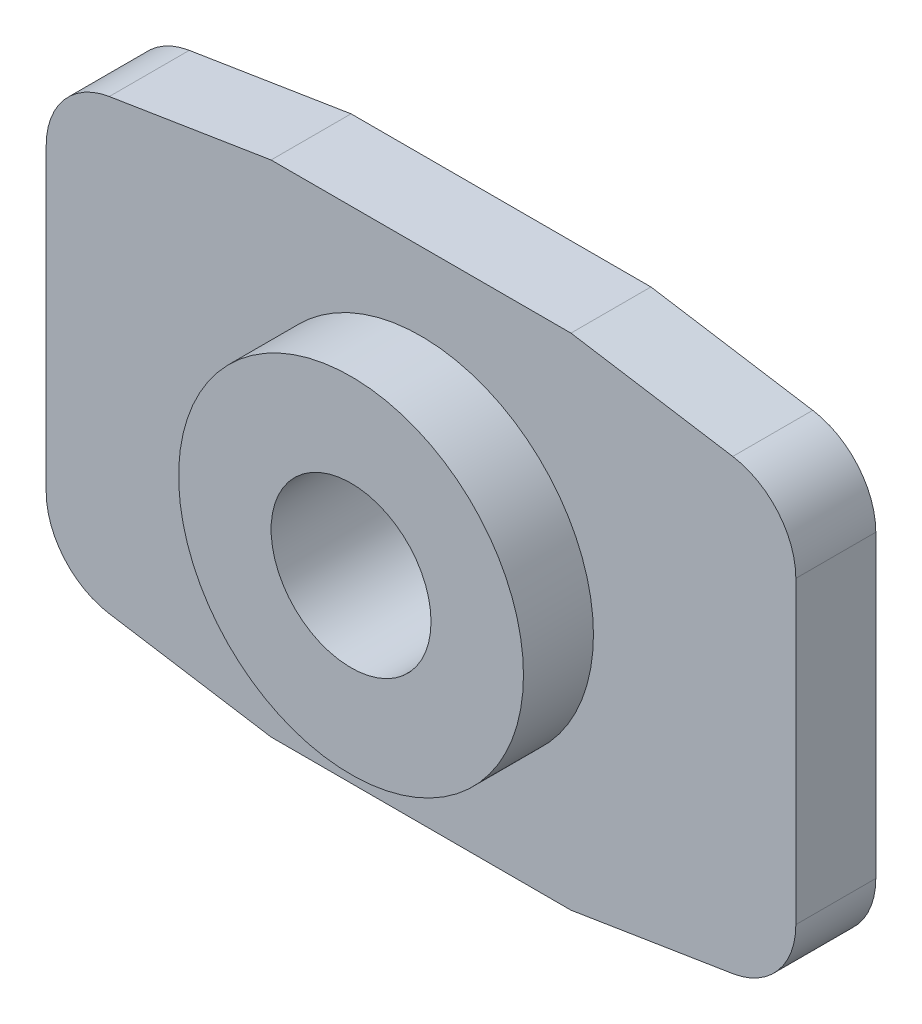
ISO-10303-21;
HEADER;
FILE_DESCRIPTION(('STEP AP214'),'2;1');
FILE_NAME('part.step','',(''),(''),'','','');
FILE_SCHEMA(('AUTOMOTIVE_DESIGN { 1 0 10303 214 1 1 1 1 }'));
ENDSEC;
DATA;
#1=APPLICATION_CONTEXT('core data for automotive mechanical design processes');
#2=APPLICATION_PROTOCOL_DEFINITION('international standard','automotive_design',2000,#1);
#3=PRODUCT_CONTEXT('',#1,'mechanical');
#4=PRODUCT('Part','Part','',(#3));
#5=PRODUCT_RELATED_PRODUCT_CATEGORY('part','',(#4));
#6=PRODUCT_DEFINITION_FORMATION('','',#4);
#7=PRODUCT_DEFINITION_CONTEXT('part definition',#1,'design');
#8=PRODUCT_DEFINITION('design','',#6,#7);
#9=PRODUCT_DEFINITION_SHAPE('','',#8);
#10=(LENGTH_UNIT() NAMED_UNIT(*) SI_UNIT(.MILLI.,.METRE.));
#11=(NAMED_UNIT(*) PLANE_ANGLE_UNIT() SI_UNIT($,.RADIAN.));
#12=(NAMED_UNIT(*) SI_UNIT($,.STERADIAN.) SOLID_ANGLE_UNIT());
#13=UNCERTAINTY_MEASURE_WITH_UNIT(LENGTH_MEASURE(1.E-05),#10,'distance_accuracy_value','');
#14=(GEOMETRIC_REPRESENTATION_CONTEXT(3) GLOBAL_UNCERTAINTY_ASSIGNED_CONTEXT((#13)) GLOBAL_UNIT_ASSIGNED_CONTEXT((#10,
#11,#12)) REPRESENTATION_CONTEXT('',''));
#15=CARTESIAN_POINT('',(0.,0.,0.));
#16=DIRECTION('',(0.,0.,1.));
#17=DIRECTION('',(1.,0.,0.));
#18=AXIS2_PLACEMENT_3D('',#15,#16,#17);
#19=CARTESIAN_POINT('',(6.,3.,1.6));
#20=DIRECTION('',(0.,0.,1.));
#21=DIRECTION('',(1.,0.,0.));
#22=AXIS2_PLACEMENT_3D('',#19,#20,#21);
#23=PLANE('',#22);
#24=CARTESIAN_POINT('',(6.,3.,1.6));
#25=DIRECTION('',(0.,0.,1.));
#26=DIRECTION('',(1.,0.,0.));
#27=AXIS2_PLACEMENT_3D('',#24,#25,#26);
#28=CIRCLE('',#27,1.5);
#29=CARTESIAN_POINT('',(7.5,3.,1.6));
#30=VERTEX_POINT('',#29);
#31=CARTESIAN_POINT('',(6.23739675280407,4.48109512920611,1.6));
#32=VERTEX_POINT('',#31);
#33=EDGE_CURVE('E198',#30,#32,#28,.T.);
#34=ORIENTED_EDGE('',*,*,#33,.T.);
#35=DIRECTION('',(-0.987396752804077,0.158264501869385,0.));
#36=VECTOR('',#35,1.);
#37=CARTESIAN_POINT('',(6.23739675280407,4.48109512920611,1.6));
#38=LINE('',#37,#36);
#39=CARTESIAN_POINT('',(3.,5.,1.6));
#40=VERTEX_POINT('',#39);
#41=EDGE_CURVE('E107',#32,#40,#38,.T.);
#42=ORIENTED_EDGE('',*,*,#41,.T.);
#43=DIRECTION('',(-1.,0.,0.));
#44=VECTOR('',#43,1.);
#45=CARTESIAN_POINT('',(-3.,5.,1.6));
#46=LINE('',#45,#44);
#47=CARTESIAN_POINT('',(-3.,5.,1.6));
#48=VERTEX_POINT('',#47);
#49=EDGE_CURVE('E237',#40,#48,#46,.T.);
#50=ORIENTED_EDGE('',*,*,#49,.T.);
#51=DIRECTION('',(-0.987396752804077,-0.158264501869386,0.));
#52=VECTOR('',#51,1.);
#53=CARTESIAN_POINT('',(-6.23739675280407,4.48109512920611,1.6));
#54=LINE('',#53,#52);
#55=CARTESIAN_POINT('',(-6.23739675280407,4.48109512920611,1.6));
#56=VERTEX_POINT('',#55);
#57=EDGE_CURVE('E256',#48,#56,#54,.T.);
#58=ORIENTED_EDGE('',*,*,#57,.T.);
#59=CARTESIAN_POINT('',(-6.,3.,1.6));
#60=DIRECTION('',(0.,0.,1.));
#61=DIRECTION('',(-1.,0.,0.));
#62=AXIS2_PLACEMENT_3D('',#59,#60,#61);
#63=CIRCLE('',#62,1.5);
#64=CARTESIAN_POINT('',(-7.5,3.,1.6));
#65=VERTEX_POINT('',#64);
#66=EDGE_CURVE('E252',#56,#65,#63,.T.);
#67=ORIENTED_EDGE('',*,*,#66,.T.);
#68=DIRECTION('',(0.,-1.,0.));
#69=VECTOR('',#68,1.);
#70=CARTESIAN_POINT('',(-7.5,-3.,1.6));
#71=LINE('',#70,#69);
#72=CARTESIAN_POINT('',(-7.5,-3.,1.6));
#73=VERTEX_POINT('',#72);
#74=EDGE_CURVE('E255',#65,#73,#71,.T.);
#75=ORIENTED_EDGE('',*,*,#74,.T.);
#76=CARTESIAN_POINT('',(-6.,-3.,1.6));
#77=DIRECTION('',(0.,0.,1.));
#78=DIRECTION('',(1.,0.,0.));
#79=AXIS2_PLACEMENT_3D('',#76,#77,#78);
#80=CIRCLE('',#79,1.5);
#81=CARTESIAN_POINT('',(-6.23739675280407,-4.48109512920612,1.6));
#82=VERTEX_POINT('',#81);
#83=EDGE_CURVE('E261',#73,#82,#80,.T.);
#84=ORIENTED_EDGE('',*,*,#83,.T.);
#85=DIRECTION('',(0.987396752804077,-0.158264501869385,0.));
#86=VECTOR('',#85,1.);
#87=CARTESIAN_POINT('',(-6.23739675280407,-4.48109512920612,1.6));
#88=LINE('',#87,#86);
#89=CARTESIAN_POINT('',(-3.,-5.,1.6));
#90=VERTEX_POINT('',#89);
#91=EDGE_CURVE('E269',#82,#90,#88,.T.);
#92=ORIENTED_EDGE('',*,*,#91,.T.);
#93=DIRECTION('',(1.,0.,0.));
#94=VECTOR('',#93,1.);
#95=CARTESIAN_POINT('',(-3.,-5.,1.6));
#96=LINE('',#95,#94);
#97=CARTESIAN_POINT('',(3.,-5.,1.6));
#98=VERTEX_POINT('',#97);
#99=EDGE_CURVE('E138',#90,#98,#96,.T.);
#100=ORIENTED_EDGE('',*,*,#99,.T.);
#101=DIRECTION('',(0.987396752804077,0.158264501869385,0.));
#102=VECTOR('',#101,1.);
#103=CARTESIAN_POINT('',(6.23739675280407,-4.48109512920611,1.6));
#104=LINE('',#103,#102);
#105=CARTESIAN_POINT('',(6.23739675280407,-4.48109512920612,1.6));
#106=VERTEX_POINT('',#105);
#107=EDGE_CURVE('E132',#98,#106,#104,.T.);
#108=ORIENTED_EDGE('',*,*,#107,.T.);
#109=CARTESIAN_POINT('',(6.,-3.,1.6));
#110=DIRECTION('',(0.,0.,1.));
#111=DIRECTION('',(-1.,0.,0.));
#112=AXIS2_PLACEMENT_3D('',#109,#110,#111);
#113=CIRCLE('',#112,1.5);
#114=CARTESIAN_POINT('',(7.5,-3.,1.6));
#115=VERTEX_POINT('',#114);
#116=EDGE_CURVE('E136',#106,#115,#113,.T.);
#117=ORIENTED_EDGE('',*,*,#116,.T.);
#118=DIRECTION('',(0.,1.,0.));
#119=VECTOR('',#118,1.);
#120=CARTESIAN_POINT('',(7.5,-3.,1.6));
#121=LINE('',#120,#119);
#122=EDGE_CURVE('E52',#115,#30,#121,.T.);
#123=ORIENTED_EDGE('',*,*,#122,.T.);
#124=EDGE_LOOP('',(#34,#42,#50,#58,#67,#75,#84,#92,#100,#108,#117,#123));
#125=FACE_BOUND('',#124,.T.);
#126=CARTESIAN_POINT('',(0.,0.,1.6));
#127=DIRECTION('',(0.,0.,1.));
#128=DIRECTION('',(1.,0.,0.));
#129=AXIS2_PLACEMENT_3D('',#126,#127,#128);
#130=CIRCLE('',#129,3.45);
#131=CARTESIAN_POINT('',(3.45,0.,1.6));
#132=VERTEX_POINT('',#131);
#133=EDGE_CURVE('E336',#132,#132,#130,.T.);
#134=ORIENTED_EDGE('',*,*,#133,.F.);
#135=EDGE_LOOP('',(#134));
#136=FACE_BOUND('',#135,.T.);
#137=ADVANCED_FACE('F34',(#125,#136),#23,.T.);
#138=CARTESIAN_POINT('',(6.,3.,1.6));
#139=DIRECTION('',(0.,0.,-1.));
#140=DIRECTION('',(-1.,0.,0.));
#141=AXIS2_PLACEMENT_3D('',#138,#139,#140);
#142=CYLINDRICAL_SURFACE('',#141,1.5);
#143=CARTESIAN_POINT('',(6.,3.,0.));
#144=DIRECTION('',(0.,0.,1.));
#145=DIRECTION('',(1.,0.,0.));
#146=AXIS2_PLACEMENT_3D('',#143,#144,#145);
#147=CIRCLE('',#146,1.5);
#148=CARTESIAN_POINT('',(7.5,3.,0.));
#149=VERTEX_POINT('',#148);
#150=CARTESIAN_POINT('',(6.23739675280407,4.48109512920611,0.));
#151=VERTEX_POINT('',#150);
#152=EDGE_CURVE('E163',#149,#151,#147,.T.);
#153=ORIENTED_EDGE('',*,*,#152,.T.);
#154=DIRECTION('',(0.,0.,-1.));
#155=VECTOR('',#154,1.);
#156=CARTESIAN_POINT('',(6.23739675280407,4.48109512920611,1.6));
#157=LINE('',#156,#155);
#158=EDGE_CURVE('E11',#32,#151,#157,.T.);
#159=ORIENTED_EDGE('',*,*,#158,.F.);
#160=ORIENTED_EDGE('',*,*,#33,.F.);
#161=DIRECTION('',(0.,0.,-1.));
#162=VECTOR('',#161,1.);
#163=CARTESIAN_POINT('',(7.5,3.,1.6));
#164=LINE('',#163,#162);
#165=EDGE_CURVE('E159',#30,#149,#164,.T.);
#166=ORIENTED_EDGE('',*,*,#165,.T.);
#167=EDGE_LOOP('',(#153,#159,#160,#166));
#168=FACE_BOUND('',#167,.T.);
#169=ADVANCED_FACE('F36',(#168),#142,.T.);
#170=CARTESIAN_POINT('',(6.23739675280407,4.48109512920611,1.6));
#171=DIRECTION('',(-0.158264501869385,-0.987396752804077,0.));
#172=DIRECTION('',(0.987396752804077,-0.158264501869385,0.));
#173=AXIS2_PLACEMENT_3D('',#170,#171,#172);
#174=PLANE('',#173);
#175=DIRECTION('',(-0.987396752804077,0.158264501869385,0.));
#176=VECTOR('',#175,1.);
#177=CARTESIAN_POINT('',(6.23739675280407,4.48109512920611,0.));
#178=LINE('',#177,#176);
#179=CARTESIAN_POINT('',(3.,5.,0.));
#180=VERTEX_POINT('',#179);
#181=EDGE_CURVE('E167',#151,#180,#178,.T.);
#182=ORIENTED_EDGE('',*,*,#181,.T.);
#183=DIRECTION('',(0.,0.,-1.));
#184=VECTOR('',#183,1.);
#185=CARTESIAN_POINT('',(3.,5.,1.6));
#186=LINE('',#185,#184);
#187=EDGE_CURVE('E44',#40,#180,#186,.T.);
#188=ORIENTED_EDGE('',*,*,#187,.F.);
#189=ORIENTED_EDGE('',*,*,#41,.F.);
#190=ORIENTED_EDGE('',*,*,#158,.T.);
#191=EDGE_LOOP('',(#182,#188,#189,#190));
#192=FACE_BOUND('',#191,.T.);
#193=ADVANCED_FACE('F324',(#192),#174,.F.);
#194=CARTESIAN_POINT('',(-3.,5.,1.6));
#195=DIRECTION('',(0.,-1.,0.));
#196=DIRECTION('',(0.,0.,-1.));
#197=AXIS2_PLACEMENT_3D('',#194,#195,#196);
#198=PLANE('',#197);
#199=DIRECTION('',(-1.,0.,0.));
#200=VECTOR('',#199,1.);
#201=CARTESIAN_POINT('',(-3.,5.,0.));
#202=LINE('',#201,#200);
#203=CARTESIAN_POINT('',(-3.,5.,0.));
#204=VERTEX_POINT('',#203);
#205=EDGE_CURVE('E171',#180,#204,#202,.T.);
#206=ORIENTED_EDGE('',*,*,#205,.T.);
#207=DIRECTION('',(0.,0.,-1.));
#208=VECTOR('',#207,1.);
#209=CARTESIAN_POINT('',(-3.,5.,1.6));
#210=LINE('',#209,#208);
#211=EDGE_CURVE('E224',#48,#204,#210,.T.);
#212=ORIENTED_EDGE('',*,*,#211,.F.);
#213=ORIENTED_EDGE('',*,*,#49,.F.);
#214=ORIENTED_EDGE('',*,*,#187,.T.);
#215=EDGE_LOOP('',(#206,#212,#213,#214));
#216=FACE_BOUND('',#215,.T.);
#217=ADVANCED_FACE('F235',(#216),#198,.F.);
#218=CARTESIAN_POINT('',(-6.23739675280407,4.48109512920611,1.6));
#219=DIRECTION('',(0.158264501869386,-0.987396752804077,0.));
#220=DIRECTION('',(0.987396752804077,0.158264501869386,0.));
#221=AXIS2_PLACEMENT_3D('',#218,#219,#220);
#222=PLANE('',#221);
#223=DIRECTION('',(-0.987396752804077,-0.158264501869386,0.));
#224=VECTOR('',#223,1.);
#225=CARTESIAN_POINT('',(-6.23739675280407,4.48109512920611,0.));
#226=LINE('',#225,#224);
#227=CARTESIAN_POINT('',(-6.23739675280407,4.48109512920611,0.));
#228=VERTEX_POINT('',#227);
#229=EDGE_CURVE('E174',#204,#228,#226,.T.);
#230=ORIENTED_EDGE('',*,*,#229,.T.);
#231=DIRECTION('',(0.,0.,-1.));
#232=VECTOR('',#231,1.);
#233=CARTESIAN_POINT('',(-6.23739675280407,4.48109512920611,1.6));
#234=LINE('',#233,#232);
#235=EDGE_CURVE('E220',#56,#228,#234,.T.);
#236=ORIENTED_EDGE('',*,*,#235,.F.);
#237=ORIENTED_EDGE('',*,*,#57,.F.);
#238=ORIENTED_EDGE('',*,*,#211,.T.);
#239=EDGE_LOOP('',(#230,#236,#237,#238));
#240=FACE_BOUND('',#239,.T.);
#241=ADVANCED_FACE('F246',(#240),#222,.F.);
#242=CARTESIAN_POINT('',(-6.,3.,1.6));
#243=DIRECTION('',(0.,0.,-1.));
#244=DIRECTION('',(-1.,0.,0.));
#245=AXIS2_PLACEMENT_3D('',#242,#243,#244);
#246=CYLINDRICAL_SURFACE('',#245,1.5);
#247=CARTESIAN_POINT('',(-6.,3.,0.));
#248=DIRECTION('',(0.,0.,1.));
#249=DIRECTION('',(-1.,0.,0.));
#250=AXIS2_PLACEMENT_3D('',#247,#248,#249);
#251=CIRCLE('',#250,1.5);
#252=CARTESIAN_POINT('',(-7.5,3.,0.));
#253=VERTEX_POINT('',#252);
#254=EDGE_CURVE('E177',#228,#253,#251,.T.);
#255=ORIENTED_EDGE('',*,*,#254,.T.);
#256=DIRECTION('',(0.,0.,-1.));
#257=VECTOR('',#256,1.);
#258=CARTESIAN_POINT('',(-7.5,3.,1.6));
#259=LINE('',#258,#257);
#260=EDGE_CURVE('E216',#65,#253,#259,.T.);
#261=ORIENTED_EDGE('',*,*,#260,.F.);
#262=ORIENTED_EDGE('',*,*,#66,.F.);
#263=ORIENTED_EDGE('',*,*,#235,.T.);
#264=EDGE_LOOP('',(#255,#261,#262,#263));
#265=FACE_BOUND('',#264,.T.);
#266=ADVANCED_FACE('F250',(#265),#246,.T.);
#267=CARTESIAN_POINT('',(-7.5,-3.,1.6));
#268=DIRECTION('',(1.,0.,0.));
#269=DIRECTION('',(0.,0.,-1.));
#270=AXIS2_PLACEMENT_3D('',#267,#268,#269);
#271=PLANE('',#270);
#272=DIRECTION('',(0.,-1.,0.));
#273=VECTOR('',#272,1.);
#274=CARTESIAN_POINT('',(-7.5,-3.,0.));
#275=LINE('',#274,#273);
#276=CARTESIAN_POINT('',(-7.5,-3.,0.));
#277=VERTEX_POINT('',#276);
#278=EDGE_CURVE('E180',#253,#277,#275,.T.);
#279=ORIENTED_EDGE('',*,*,#278,.T.);
#280=DIRECTION('',(0.,0.,-1.));
#281=VECTOR('',#280,1.);
#282=CARTESIAN_POINT('',(-7.5,-3.,1.6));
#283=LINE('',#282,#281);
#284=EDGE_CURVE('E213',#73,#277,#283,.T.);
#285=ORIENTED_EDGE('',*,*,#284,.F.);
#286=ORIENTED_EDGE('',*,*,#74,.F.);
#287=ORIENTED_EDGE('',*,*,#260,.T.);
#288=EDGE_LOOP('',(#279,#285,#286,#287));
#289=FACE_BOUND('',#288,.T.);
#290=ADVANCED_FACE('F390',(#289),#271,.F.);
#291=CARTESIAN_POINT('',(-6.,-3.,1.6));
#292=DIRECTION('',(0.,0.,-1.));
#293=DIRECTION('',(-1.,0.,0.));
#294=AXIS2_PLACEMENT_3D('',#291,#292,#293);
#295=CYLINDRICAL_SURFACE('',#294,1.5);
#296=CARTESIAN_POINT('',(-6.,-3.,0.));
#297=DIRECTION('',(0.,0.,1.));
#298=DIRECTION('',(1.,0.,0.));
#299=AXIS2_PLACEMENT_3D('',#296,#297,#298);
#300=CIRCLE('',#299,1.5);
#301=CARTESIAN_POINT('',(-6.23739675280407,-4.48109512920612,0.));
#302=VERTEX_POINT('',#301);
#303=EDGE_CURVE('E183',#277,#302,#300,.T.);
#304=ORIENTED_EDGE('',*,*,#303,.T.);
#305=DIRECTION('',(0.,0.,-1.));
#306=VECTOR('',#305,1.);
#307=CARTESIAN_POINT('',(-6.23739675280407,-4.48109512920612,1.6));
#308=LINE('',#307,#306);
#309=EDGE_CURVE('E209',#82,#302,#308,.T.);
#310=ORIENTED_EDGE('',*,*,#309,.F.);
#311=ORIENTED_EDGE('',*,*,#83,.F.);
#312=ORIENTED_EDGE('',*,*,#284,.T.);
#313=EDGE_LOOP('',(#304,#310,#311,#312));
#314=FACE_BOUND('',#313,.T.);
#315=ADVANCED_FACE('F386',(#314),#295,.T.);
#316=CARTESIAN_POINT('',(-6.23739675280407,-4.48109512920612,1.6));
#317=DIRECTION('',(0.158264501869385,0.987396752804077,0.));
#318=DIRECTION('',(-0.987396752804077,0.158264501869385,0.));
#319=AXIS2_PLACEMENT_3D('',#316,#317,#318);
#320=PLANE('',#319);
#321=DIRECTION('',(0.987396752804077,-0.158264501869385,0.));
#322=VECTOR('',#321,1.);
#323=CARTESIAN_POINT('',(-6.23739675280407,-4.48109512920612,0.));
#324=LINE('',#323,#322);
#325=CARTESIAN_POINT('',(-3.,-5.,0.));
#326=VERTEX_POINT('',#325);
#327=EDGE_CURVE('E186',#302,#326,#324,.T.);
#328=ORIENTED_EDGE('',*,*,#327,.T.);
#329=DIRECTION('',(0.,0.,-1.));
#330=VECTOR('',#329,1.);
#331=CARTESIAN_POINT('',(-3.,-5.,1.6));
#332=LINE('',#331,#330);
#333=EDGE_CURVE('E205',#90,#326,#332,.T.);
#334=ORIENTED_EDGE('',*,*,#333,.F.);
#335=ORIENTED_EDGE('',*,*,#91,.F.);
#336=ORIENTED_EDGE('',*,*,#309,.T.);
#337=EDGE_LOOP('',(#328,#334,#335,#336));
#338=FACE_BOUND('',#337,.T.);
#339=ADVANCED_FACE('F297',(#338),#320,.F.);
#340=CARTESIAN_POINT('',(-3.,-5.,1.6));
#341=DIRECTION('',(0.,1.,0.));
#342=DIRECTION('',(0.,0.,1.));
#343=AXIS2_PLACEMENT_3D('',#340,#341,#342);
#344=PLANE('',#343);
#345=DIRECTION('',(1.,0.,0.));
#346=VECTOR('',#345,1.);
#347=CARTESIAN_POINT('',(-3.,-5.,0.));
#348=LINE('',#347,#346);
#349=CARTESIAN_POINT('',(3.,-5.,0.));
#350=VERTEX_POINT('',#349);
#351=EDGE_CURVE('E189',#326,#350,#348,.T.);
#352=ORIENTED_EDGE('',*,*,#351,.T.);
#353=DIRECTION('',(0.,0.,-1.));
#354=VECTOR('',#353,1.);
#355=CARTESIAN_POINT('',(3.,-5.,1.6));
#356=LINE('',#355,#354);
#357=EDGE_CURVE('E149',#98,#350,#356,.T.);
#358=ORIENTED_EDGE('',*,*,#357,.F.);
#359=ORIENTED_EDGE('',*,*,#99,.F.);
#360=ORIENTED_EDGE('',*,*,#333,.T.);
#361=EDGE_LOOP('',(#352,#358,#359,#360));
#362=FACE_BOUND('',#361,.T.);
#363=ADVANCED_FACE('F293',(#362),#344,.F.);
#364=CARTESIAN_POINT('',(6.23739675280407,-4.48109512920611,1.6));
#365=DIRECTION('',(-0.158264501869385,0.987396752804077,0.));
#366=DIRECTION('',(-0.987396752804077,-0.158264501869385,0.));
#367=AXIS2_PLACEMENT_3D('',#364,#365,#366);
#368=PLANE('',#367);
#369=DIRECTION('',(0.987396752804077,0.158264501869385,0.));
#370=VECTOR('',#369,1.);
#371=CARTESIAN_POINT('',(6.23739675280407,-4.48109512920611,0.));
#372=LINE('',#371,#370);
#373=CARTESIAN_POINT('',(6.23739675280407,-4.48109512920612,0.));
#374=VERTEX_POINT('',#373);
#375=EDGE_CURVE('E147',#350,#374,#372,.T.);
#376=ORIENTED_EDGE('',*,*,#375,.T.);
#377=DIRECTION('',(0.,0.,-1.));
#378=VECTOR('',#377,1.);
#379=CARTESIAN_POINT('',(6.23739675280407,-4.48109512920612,1.6));
#380=LINE('',#379,#378);
#381=EDGE_CURVE('E144',#106,#374,#380,.T.);
#382=ORIENTED_EDGE('',*,*,#381,.F.);
#383=ORIENTED_EDGE('',*,*,#107,.F.);
#384=ORIENTED_EDGE('',*,*,#357,.T.);
#385=EDGE_LOOP('',(#376,#382,#383,#384));
#386=FACE_BOUND('',#385,.T.);
#387=ADVANCED_FACE('F145',(#386),#368,.F.);
#388=CARTESIAN_POINT('',(6.,-3.,1.6));
#389=DIRECTION('',(0.,0.,-1.));
#390=DIRECTION('',(-1.,0.,0.));
#391=AXIS2_PLACEMENT_3D('',#388,#389,#390);
#392=CYLINDRICAL_SURFACE('',#391,1.5);
#393=CARTESIAN_POINT('',(6.,-3.,0.));
#394=DIRECTION('',(0.,0.,1.));
#395=DIRECTION('',(-1.,0.,0.));
#396=AXIS2_PLACEMENT_3D('',#393,#394,#395);
#397=CIRCLE('',#396,1.5);
#398=CARTESIAN_POINT('',(7.5,-3.,0.));
#399=VERTEX_POINT('',#398);
#400=EDGE_CURVE('E93',#374,#399,#397,.T.);
#401=ORIENTED_EDGE('',*,*,#400,.T.);
#402=DIRECTION('',(0.,0.,-1.));
#403=VECTOR('',#402,1.);
#404=CARTESIAN_POINT('',(7.5,-3.,1.6));
#405=LINE('',#404,#403);
#406=EDGE_CURVE('E150',#115,#399,#405,.T.);
#407=ORIENTED_EDGE('',*,*,#406,.F.);
#408=ORIENTED_EDGE('',*,*,#116,.F.);
#409=ORIENTED_EDGE('',*,*,#381,.T.);
#410=EDGE_LOOP('',(#401,#407,#408,#409));
#411=FACE_BOUND('',#410,.T.);
#412=ADVANCED_FACE('F152',(#411),#392,.T.);
#413=CARTESIAN_POINT('',(7.5,-3.,1.6));
#414=DIRECTION('',(-1.,0.,0.));
#415=DIRECTION('',(0.,-1.,0.));
#416=AXIS2_PLACEMENT_3D('',#413,#414,#415);
#417=PLANE('',#416);
#418=DIRECTION('',(0.,1.,0.));
#419=VECTOR('',#418,1.);
#420=CARTESIAN_POINT('',(7.5,-3.,0.));
#421=LINE('',#420,#419);
#422=EDGE_CURVE('E99',#399,#149,#421,.T.);
#423=ORIENTED_EDGE('',*,*,#422,.T.);
#424=ORIENTED_EDGE('',*,*,#165,.F.);
#425=ORIENTED_EDGE('',*,*,#122,.F.);
#426=ORIENTED_EDGE('',*,*,#406,.T.);
#427=EDGE_LOOP('',(#423,#424,#425,#426));
#428=FACE_BOUND('',#427,.T.);
#429=ADVANCED_FACE('F281',(#428),#417,.F.);
#430=CARTESIAN_POINT('',(6.,3.,0.));
#431=DIRECTION('',(0.,0.,1.));
#432=DIRECTION('',(1.,0.,0.));
#433=AXIS2_PLACEMENT_3D('',#430,#431,#432);
#434=PLANE('',#433);
#435=CARTESIAN_POINT('',(0.,0.,0.));
#436=DIRECTION('',(0.,0.,1.));
#437=DIRECTION('',(1.,0.,0.));
#438=AXIS2_PLACEMENT_3D('',#435,#436,#437);
#439=CIRCLE('',#438,1.6);
#440=CARTESIAN_POINT('',(1.6,0.,0.));
#441=VERTEX_POINT('',#440);
#442=EDGE_CURVE('E333',#441,#441,#439,.T.);
#443=ORIENTED_EDGE('',*,*,#442,.T.);
#444=EDGE_LOOP('',(#443));
#445=FACE_BOUND('',#444,.T.);
#446=ORIENTED_EDGE('',*,*,#152,.F.);
#447=ORIENTED_EDGE('',*,*,#422,.F.);
#448=ORIENTED_EDGE('',*,*,#400,.F.);
#449=ORIENTED_EDGE('',*,*,#375,.F.);
#450=ORIENTED_EDGE('',*,*,#351,.F.);
#451=ORIENTED_EDGE('',*,*,#327,.F.);
#452=ORIENTED_EDGE('',*,*,#303,.F.);
#453=ORIENTED_EDGE('',*,*,#278,.F.);
#454=ORIENTED_EDGE('',*,*,#254,.F.);
#455=ORIENTED_EDGE('',*,*,#229,.F.);
#456=ORIENTED_EDGE('',*,*,#205,.F.);
#457=ORIENTED_EDGE('',*,*,#181,.F.);
#458=EDGE_LOOP('',(#446,#447,#448,#449,#450,#451,#452,#453,#454,#455,#456,#457));
#459=FACE_BOUND('',#458,.T.);
#460=ADVANCED_FACE('F241',(#445,#459),#434,.F.);
#461=CARTESIAN_POINT('',(0.,0.,3.));
#462=DIRECTION('',(0.,0.,-1.));
#463=DIRECTION('',(-1.,0.,0.));
#464=AXIS2_PLACEMENT_3D('',#461,#462,#463);
#465=CYLINDRICAL_SURFACE('',#464,3.45);
#466=CARTESIAN_POINT('',(0.,0.,3.));
#467=DIRECTION('',(0.,0.,1.));
#468=DIRECTION('',(1.,0.,0.));
#469=AXIS2_PLACEMENT_3D('',#466,#467,#468);
#470=CIRCLE('',#469,3.45);
#471=CARTESIAN_POINT('',(3.45,0.,3.));
#472=VERTEX_POINT('',#471);
#473=EDGE_CURVE('E168',#472,#472,#470,.T.);
#474=ORIENTED_EDGE('',*,*,#473,.F.);
#475=EDGE_LOOP('',(#474));
#476=FACE_BOUND('',#475,.T.);
#477=ORIENTED_EDGE('',*,*,#133,.T.);
#478=EDGE_LOOP('',(#477));
#479=FACE_BOUND('',#478,.T.);
#480=ADVANCED_FACE('F280',(#476,#479),#465,.T.);
#481=CARTESIAN_POINT('',(0.,0.,3.));
#482=DIRECTION('',(0.,0.,1.));
#483=DIRECTION('',(1.,0.,0.));
#484=AXIS2_PLACEMENT_3D('',#481,#482,#483);
#485=PLANE('',#484);
#486=CARTESIAN_POINT('',(0.,0.,3.));
#487=DIRECTION('',(0.,0.,1.));
#488=DIRECTION('',(1.,0.,0.));
#489=AXIS2_PLACEMENT_3D('',#486,#487,#488);
#490=CIRCLE('',#489,1.6);
#491=CARTESIAN_POINT('',(1.6,0.,3.));
#492=VERTEX_POINT('',#491);
#493=EDGE_CURVE('E337',#492,#492,#490,.T.);
#494=ORIENTED_EDGE('',*,*,#493,.F.);
#495=EDGE_LOOP('',(#494));
#496=FACE_BOUND('',#495,.T.);
#497=ORIENTED_EDGE('',*,*,#473,.T.);
#498=EDGE_LOOP('',(#497));
#499=FACE_BOUND('',#498,.T.);
#500=ADVANCED_FACE('F310',(#496,#499),#485,.T.);
#501=CARTESIAN_POINT('',(0.,0.,3.));
#502=DIRECTION('',(0.,0.,1.));
#503=DIRECTION('',(1.,0.,0.));
#504=AXIS2_PLACEMENT_3D('',#501,#502,#503);
#505=CYLINDRICAL_SURFACE('',#504,1.6);
#506=ORIENTED_EDGE('',*,*,#442,.F.);
#507=EDGE_LOOP('',(#506));
#508=FACE_BOUND('',#507,.T.);
#509=ORIENTED_EDGE('',*,*,#493,.T.);
#510=EDGE_LOOP('',(#509));
#511=FACE_BOUND('',#510,.T.);
#512=ADVANCED_FACE('F273',(#508,#511),#505,.F.);
#513=CLOSED_SHELL('',(#137,#169,#193,#217,#241,#266,#290,#315,#339,#363,#387,#412,#429,#460,
#480,#500,#512));
#514=MANIFOLD_SOLID_BREP('B2',#513);
#515=ADVANCED_BREP_SHAPE_REPRESENTATION('',(#18,#514),#14);
#516=SHAPE_DEFINITION_REPRESENTATION(#9,#515);
ENDSEC;
END-ISO-10303-21;
